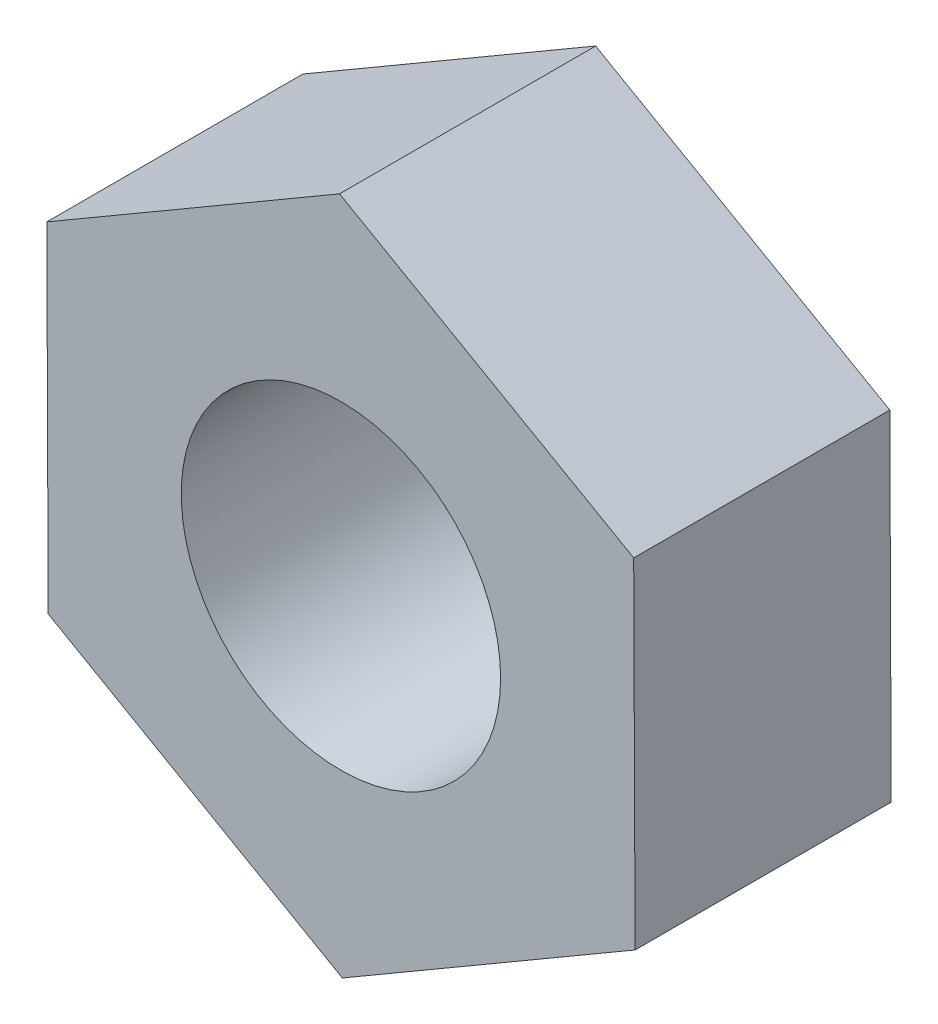
ISO-10303-21;
HEADER;
FILE_DESCRIPTION(('STEP AP214'),'2;1');
FILE_NAME('part.step','',(''),(''),'','','');
FILE_SCHEMA(('AUTOMOTIVE_DESIGN { 1 0 10303 214 1 1 1 1 }'));
ENDSEC;
DATA;
#1=APPLICATION_CONTEXT('core data for automotive mechanical design processes');
#2=APPLICATION_PROTOCOL_DEFINITION('international standard','automotive_design',2000,#1);
#3=PRODUCT_CONTEXT('',#1,'mechanical');
#4=PRODUCT('Part','Part','',(#3));
#5=PRODUCT_RELATED_PRODUCT_CATEGORY('part','',(#4));
#6=PRODUCT_DEFINITION_FORMATION('','',#4);
#7=PRODUCT_DEFINITION_CONTEXT('part definition',#1,'design');
#8=PRODUCT_DEFINITION('design','',#6,#7);
#9=PRODUCT_DEFINITION_SHAPE('','',#8);
#10=(LENGTH_UNIT() NAMED_UNIT(*) SI_UNIT(.MILLI.,.METRE.));
#11=(NAMED_UNIT(*) PLANE_ANGLE_UNIT() SI_UNIT($,.RADIAN.));
#12=(NAMED_UNIT(*) SI_UNIT($,.STERADIAN.) SOLID_ANGLE_UNIT());
#13=UNCERTAINTY_MEASURE_WITH_UNIT(LENGTH_MEASURE(1.E-05),#10,'distance_accuracy_value','');
#14=(GEOMETRIC_REPRESENTATION_CONTEXT(3) GLOBAL_UNCERTAINTY_ASSIGNED_CONTEXT((#13)) GLOBAL_UNIT_ASSIGNED_CONTEXT((#10,
#11,#12)) REPRESENTATION_CONTEXT('',''));
#15=CARTESIAN_POINT('',(0.,0.,0.));
#16=DIRECTION('',(0.,0.,1.));
#17=DIRECTION('',(1.,0.,0.));
#18=AXIS2_PLACEMENT_3D('',#15,#16,#17);
#19=CARTESIAN_POINT('',(0.,0.,2.4));
#20=DIRECTION('',(0.,0.,1.));
#21=DIRECTION('',(1.,0.,0.));
#22=AXIS2_PLACEMENT_3D('',#19,#20,#21);
#23=PLANE('',#22);
#24=DIRECTION('',(-0.00412447403138752,0.999991494320809,0.));
#25=VECTOR('',#24,1.);
#26=CARTESIAN_POINT('',(2.75652509141102,-1.57635743210569,2.4));
#27=LINE('',#26,#25);
#28=CARTESIAN_POINT('',(2.75652509141102,-1.57635743210569,2.4));
#29=VERTEX_POINT('',#28);
#30=CARTESIAN_POINT('',(2.74342812735344,1.59904203927832,2.4));
#31=VERTEX_POINT('',#30);
#32=EDGE_CURVE('E130',#29,#31,#27,.T.);
#33=ORIENTED_EDGE('',*,*,#32,.T.);
#34=DIRECTION('',(-0.868080274665876,0.496423847871974,0.));
#35=VECTOR('',#34,1.);
#36=CARTESIAN_POINT('',(2.74342812735344,1.59904203927832,2.4));
#37=LINE('',#36,#35);
#38=CARTESIAN_POINT('',(-0.0130969640575789,3.175399471384,2.4));
#39=VERTEX_POINT('',#38);
#40=EDGE_CURVE('E88',#31,#39,#37,.T.);
#41=ORIENTED_EDGE('',*,*,#40,.T.);
#42=DIRECTION('',(-0.863955800634489,-0.503567646448835,0.));
#43=VECTOR('',#42,1.);
#44=CARTESIAN_POINT('',(-0.0130969640575789,3.175399471384,2.4));
#45=LINE('',#44,#43);
#46=CARTESIAN_POINT('',(-2.75652509141101,1.57635743210569,2.4));
#47=VERTEX_POINT('',#46);
#48=EDGE_CURVE('E101',#39,#47,#45,.T.);
#49=ORIENTED_EDGE('',*,*,#48,.T.);
#50=DIRECTION('',(0.00412447403138765,-0.999991494320809,0.));
#51=VECTOR('',#50,1.);
#52=CARTESIAN_POINT('',(-2.75652509141101,1.57635743210569,2.4));
#53=LINE('',#52,#51);
#54=CARTESIAN_POINT('',(-2.74342812735343,-1.59904203927832,2.4));
#55=VERTEX_POINT('',#54);
#56=EDGE_CURVE('E95',#47,#55,#53,.T.);
#57=ORIENTED_EDGE('',*,*,#56,.T.);
#58=DIRECTION('',(0.868080274665877,-0.496423847871974,0.));
#59=VECTOR('',#58,1.);
#60=CARTESIAN_POINT('',(-2.74342812735343,-1.59904203927832,2.4));
#61=LINE('',#60,#59);
#62=CARTESIAN_POINT('',(0.0130969640575794,-3.175399471384,2.4));
#63=VERTEX_POINT('',#62);
#64=EDGE_CURVE('E99',#55,#63,#61,.T.);
#65=ORIENTED_EDGE('',*,*,#64,.T.);
#66=DIRECTION('',(0.863955800634489,0.503567646448835,0.));
#67=VECTOR('',#66,1.);
#68=CARTESIAN_POINT('',(0.0130969640575794,-3.175399471384,2.4));
#69=LINE('',#68,#67);
#70=EDGE_CURVE('E51',#63,#29,#69,.T.);
#71=ORIENTED_EDGE('',*,*,#70,.T.);
#72=EDGE_LOOP('',(#33,#41,#49,#57,#65,#71));
#73=FACE_BOUND('',#72,.T.);
#74=CARTESIAN_POINT('',(0.,0.,2.4));
#75=DIRECTION('',(0.,0.,1.));
#76=DIRECTION('',(1.,0.,0.));
#77=AXIS2_PLACEMENT_3D('',#74,#75,#76);
#78=CIRCLE('',#77,1.49641534219279);
#79=CARTESIAN_POINT('',(1.49641534219279,0.,2.4));
#80=VERTEX_POINT('',#79);
#81=EDGE_CURVE('E123',#80,#80,#78,.T.);
#82=ORIENTED_EDGE('',*,*,#81,.F.);
#83=EDGE_LOOP('',(#82));
#84=FACE_BOUND('',#83,.T.);
#85=ADVANCED_FACE('F34',(#73,#84),#23,.T.);
#86=CARTESIAN_POINT('',(0.,0.,0.));
#87=DIRECTION('',(0.,0.,1.));
#88=DIRECTION('',(1.,0.,0.));
#89=AXIS2_PLACEMENT_3D('',#86,#87,#88);
#90=PLANE('',#89);
#91=DIRECTION('',(-0.00412447403138752,0.999991494320809,0.));
#92=VECTOR('',#91,1.);
#93=CARTESIAN_POINT('',(2.75652509141102,-1.57635743210569,0.));
#94=LINE('',#93,#92);
#95=CARTESIAN_POINT('',(2.75652509141102,-1.57635743210569,0.));
#96=VERTEX_POINT('',#95);
#97=CARTESIAN_POINT('',(2.74342812735344,1.59904203927832,0.));
#98=VERTEX_POINT('',#97);
#99=EDGE_CURVE('E119',#96,#98,#94,.T.);
#100=ORIENTED_EDGE('',*,*,#99,.F.);
#101=DIRECTION('',(0.863955800634489,0.503567646448835,0.));
#102=VECTOR('',#101,1.);
#103=CARTESIAN_POINT('',(0.0130969640575794,-3.175399471384,0.));
#104=LINE('',#103,#102);
#105=CARTESIAN_POINT('',(0.0130969640575794,-3.175399471384,0.));
#106=VERTEX_POINT('',#105);
#107=EDGE_CURVE('E80',#106,#96,#104,.T.);
#108=ORIENTED_EDGE('',*,*,#107,.F.);
#109=DIRECTION('',(0.868080274665877,-0.496423847871974,0.));
#110=VECTOR('',#109,1.);
#111=CARTESIAN_POINT('',(-2.74342812735343,-1.59904203927832,0.));
#112=LINE('',#111,#110);
#113=CARTESIAN_POINT('',(-2.74342812735343,-1.59904203927832,0.));
#114=VERTEX_POINT('',#113);
#115=EDGE_CURVE('E74',#114,#106,#112,.T.);
#116=ORIENTED_EDGE('',*,*,#115,.F.);
#117=DIRECTION('',(0.00412447403138765,-0.999991494320809,0.));
#118=VECTOR('',#117,1.);
#119=CARTESIAN_POINT('',(-2.75652509141101,1.57635743210569,0.));
#120=LINE('',#119,#118);
#121=CARTESIAN_POINT('',(-2.75652509141101,1.57635743210569,0.));
#122=VERTEX_POINT('',#121);
#123=EDGE_CURVE('E109',#122,#114,#120,.T.);
#124=ORIENTED_EDGE('',*,*,#123,.F.);
#125=DIRECTION('',(-0.863955800634489,-0.503567646448835,0.));
#126=VECTOR('',#125,1.);
#127=CARTESIAN_POINT('',(-0.0130969640575789,3.175399471384,0.));
#128=LINE('',#127,#126);
#129=CARTESIAN_POINT('',(-0.0130969640575789,3.175399471384,0.));
#130=VERTEX_POINT('',#129);
#131=EDGE_CURVE('E125',#130,#122,#128,.T.);
#132=ORIENTED_EDGE('',*,*,#131,.F.);
#133=DIRECTION('',(-0.868080274665876,0.496423847871974,0.));
#134=VECTOR('',#133,1.);
#135=CARTESIAN_POINT('',(2.74342812735344,1.59904203927832,0.));
#136=LINE('',#135,#134);
#137=EDGE_CURVE('E122',#98,#130,#136,.T.);
#138=ORIENTED_EDGE('',*,*,#137,.F.);
#139=EDGE_LOOP('',(#100,#108,#116,#124,#132,#138));
#140=FACE_BOUND('',#139,.T.);
#141=CARTESIAN_POINT('',(0.,0.,0.));
#142=DIRECTION('',(0.,0.,1.));
#143=DIRECTION('',(1.,0.,0.));
#144=AXIS2_PLACEMENT_3D('',#141,#142,#143);
#145=CIRCLE('',#144,1.49641534219279);
#146=CARTESIAN_POINT('',(1.49641534219279,0.,0.));
#147=VERTEX_POINT('',#146);
#148=EDGE_CURVE('E223',#147,#147,#145,.T.);
#149=ORIENTED_EDGE('',*,*,#148,.T.);
#150=EDGE_LOOP('',(#149));
#151=FACE_BOUND('',#150,.T.);
#152=ADVANCED_FACE('F139',(#140,#151),#90,.F.);
#153=CARTESIAN_POINT('',(2.75652509141102,-1.57635743210569,2.4));
#154=DIRECTION('',(-0.999991494320809,-0.00412447403138752,0.));
#155=DIRECTION('',(0.00412447403138752,-0.999991494320809,0.));
#156=AXIS2_PLACEMENT_3D('',#153,#154,#155);
#157=PLANE('',#156);
#158=ORIENTED_EDGE('',*,*,#99,.T.);
#159=DIRECTION('',(0.,0.,-1.));
#160=VECTOR('',#159,1.);
#161=CARTESIAN_POINT('',(2.74342812735344,1.59904203927832,2.4));
#162=LINE('',#161,#160);
#163=EDGE_CURVE('E11',#31,#98,#162,.T.);
#164=ORIENTED_EDGE('',*,*,#163,.F.);
#165=ORIENTED_EDGE('',*,*,#32,.F.);
#166=DIRECTION('',(0.,0.,-1.));
#167=VECTOR('',#166,1.);
#168=CARTESIAN_POINT('',(2.75652509141102,-1.57635743210569,2.4));
#169=LINE('',#168,#167);
#170=EDGE_CURVE('E115',#29,#96,#169,.T.);
#171=ORIENTED_EDGE('',*,*,#170,.T.);
#172=EDGE_LOOP('',(#158,#164,#165,#171));
#173=FACE_BOUND('',#172,.T.);
#174=ADVANCED_FACE('F36',(#173),#157,.F.);
#175=CARTESIAN_POINT('',(2.74342812735344,1.59904203927832,2.4));
#176=DIRECTION('',(-0.496423847871974,-0.868080274665877,0.));
#177=DIRECTION('',(0.868080274665877,-0.496423847871974,0.));
#178=AXIS2_PLACEMENT_3D('',#175,#176,#177);
#179=PLANE('',#178);
#180=ORIENTED_EDGE('',*,*,#137,.T.);
#181=DIRECTION('',(0.,0.,-1.));
#182=VECTOR('',#181,1.);
#183=CARTESIAN_POINT('',(-0.0130969640575789,3.175399471384,2.4));
#184=LINE('',#183,#182);
#185=EDGE_CURVE('E43',#39,#130,#184,.T.);
#186=ORIENTED_EDGE('',*,*,#185,.F.);
#187=ORIENTED_EDGE('',*,*,#40,.F.);
#188=ORIENTED_EDGE('',*,*,#163,.T.);
#189=EDGE_LOOP('',(#180,#186,#187,#188));
#190=FACE_BOUND('',#189,.T.);
#191=ADVANCED_FACE('F164',(#190),#179,.F.);
#192=CARTESIAN_POINT('',(-0.0130969640575789,3.175399471384,2.4));
#193=DIRECTION('',(0.503567646448835,-0.863955800634489,0.));
#194=DIRECTION('',(0.863955800634489,0.503567646448835,0.));
#195=AXIS2_PLACEMENT_3D('',#192,#193,#194);
#196=PLANE('',#195);
#197=ORIENTED_EDGE('',*,*,#131,.T.);
#198=DIRECTION('',(0.,0.,-1.));
#199=VECTOR('',#198,1.);
#200=CARTESIAN_POINT('',(-2.75652509141101,1.57635743210569,2.4));
#201=LINE('',#200,#199);
#202=EDGE_CURVE('E110',#47,#122,#201,.T.);
#203=ORIENTED_EDGE('',*,*,#202,.F.);
#204=ORIENTED_EDGE('',*,*,#48,.F.);
#205=ORIENTED_EDGE('',*,*,#185,.T.);
#206=EDGE_LOOP('',(#197,#203,#204,#205));
#207=FACE_BOUND('',#206,.T.);
#208=ADVANCED_FACE('F136',(#207),#196,.F.);
#209=CARTESIAN_POINT('',(-2.75652509141101,1.57635743210569,2.4));
#210=DIRECTION('',(0.999991494320809,0.00412447403138765,0.));
#211=DIRECTION('',(-0.00412447403138765,0.999991494320809,0.));
#212=AXIS2_PLACEMENT_3D('',#209,#210,#211);
#213=PLANE('',#212);
#214=ORIENTED_EDGE('',*,*,#123,.T.);
#215=DIRECTION('',(0.,0.,-1.));
#216=VECTOR('',#215,1.);
#217=CARTESIAN_POINT('',(-2.74342812735343,-1.59904203927832,2.4));
#218=LINE('',#217,#216);
#219=EDGE_CURVE('E106',#55,#114,#218,.T.);
#220=ORIENTED_EDGE('',*,*,#219,.F.);
#221=ORIENTED_EDGE('',*,*,#56,.F.);
#222=ORIENTED_EDGE('',*,*,#202,.T.);
#223=EDGE_LOOP('',(#214,#220,#221,#222));
#224=FACE_BOUND('',#223,.T.);
#225=ADVANCED_FACE('F107',(#224),#213,.F.);
#226=CARTESIAN_POINT('',(-2.74342812735343,-1.59904203927832,2.4));
#227=DIRECTION('',(0.496423847871974,0.868080274665877,0.));
#228=DIRECTION('',(-0.868080274665877,0.496423847871974,0.));
#229=AXIS2_PLACEMENT_3D('',#226,#227,#228);
#230=PLANE('',#229);
#231=ORIENTED_EDGE('',*,*,#115,.T.);
#232=DIRECTION('',(0.,0.,-1.));
#233=VECTOR('',#232,1.);
#234=CARTESIAN_POINT('',(0.0130969640575794,-3.175399471384,2.4));
#235=LINE('',#234,#233);
#236=EDGE_CURVE('E111',#63,#106,#235,.T.);
#237=ORIENTED_EDGE('',*,*,#236,.F.);
#238=ORIENTED_EDGE('',*,*,#64,.F.);
#239=ORIENTED_EDGE('',*,*,#219,.T.);
#240=EDGE_LOOP('',(#231,#237,#238,#239));
#241=FACE_BOUND('',#240,.T.);
#242=ADVANCED_FACE('F113',(#241),#230,.F.);
#243=CARTESIAN_POINT('',(0.0130969640575794,-3.175399471384,2.4));
#244=DIRECTION('',(-0.503567646448835,0.863955800634489,0.));
#245=DIRECTION('',(-0.863955800634489,-0.503567646448835,0.));
#246=AXIS2_PLACEMENT_3D('',#243,#244,#245);
#247=PLANE('',#246);
#248=ORIENTED_EDGE('',*,*,#107,.T.);
#249=ORIENTED_EDGE('',*,*,#170,.F.);
#250=ORIENTED_EDGE('',*,*,#70,.F.);
#251=ORIENTED_EDGE('',*,*,#236,.T.);
#252=EDGE_LOOP('',(#248,#249,#250,#251));
#253=FACE_BOUND('',#252,.T.);
#254=ADVANCED_FACE('F144',(#253),#247,.F.);
#255=CARTESIAN_POINT('',(0.,0.,2.4));
#256=DIRECTION('',(0.,0.,-1.));
#257=DIRECTION('',(-1.,0.,0.));
#258=AXIS2_PLACEMENT_3D('',#255,#256,#257);
#259=CYLINDRICAL_SURFACE('',#258,1.49641534219279);
#260=ORIENTED_EDGE('',*,*,#81,.T.);
#261=EDGE_LOOP('',(#260));
#262=FACE_BOUND('',#261,.T.);
#263=ORIENTED_EDGE('',*,*,#148,.F.);
#264=EDGE_LOOP('',(#263));
#265=FACE_BOUND('',#264,.T.);
#266=ADVANCED_FACE('F146',(#262,#265),#259,.F.);
#267=CLOSED_SHELL('',(#85,#152,#174,#191,#208,#225,#242,#254,#266));
#268=MANIFOLD_SOLID_BREP('B2',#267);
#269=ADVANCED_BREP_SHAPE_REPRESENTATION('',(#18,#268),#14);
#270=SHAPE_DEFINITION_REPRESENTATION(#9,#269);
ENDSEC;
END-ISO-10303-21;
